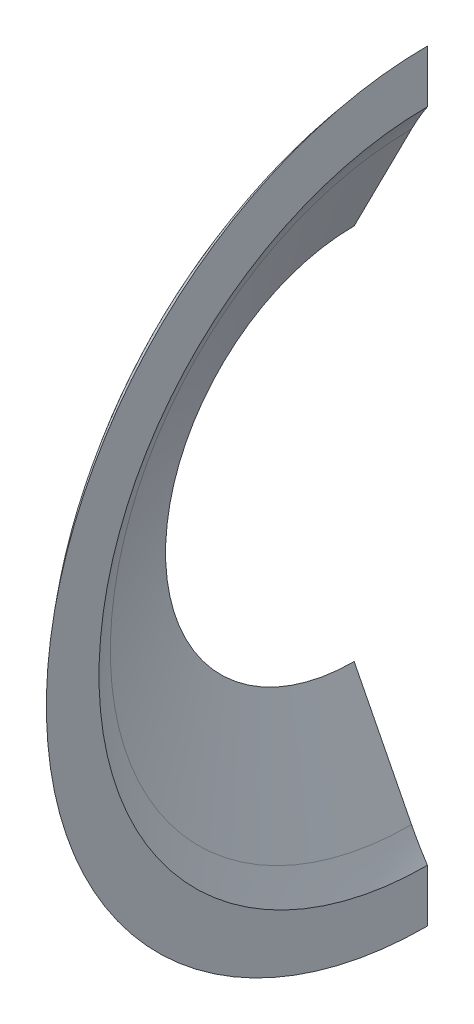
ISO-10303-21;
HEADER;
FILE_DESCRIPTION(('STEP AP214'),'2;1');
FILE_NAME('part.step','',(''),(''),'','','');
FILE_SCHEMA(('AUTOMOTIVE_DESIGN { 1 0 10303 214 1 1 1 1 }'));
ENDSEC;
DATA;
#1=APPLICATION_CONTEXT('core data for automotive mechanical design processes');
#2=APPLICATION_PROTOCOL_DEFINITION('international standard','automotive_design',2000,#1);
#3=PRODUCT_CONTEXT('',#1,'mechanical');
#4=PRODUCT('Part','Part','',(#3));
#5=PRODUCT_RELATED_PRODUCT_CATEGORY('part','',(#4));
#6=PRODUCT_DEFINITION_FORMATION('','',#4);
#7=PRODUCT_DEFINITION_CONTEXT('part definition',#1,'design');
#8=PRODUCT_DEFINITION('design','',#6,#7);
#9=PRODUCT_DEFINITION_SHAPE('','',#8);
#10=(LENGTH_UNIT() NAMED_UNIT(*) SI_UNIT(.MILLI.,.METRE.));
#11=(NAMED_UNIT(*) PLANE_ANGLE_UNIT() SI_UNIT($,.RADIAN.));
#12=(NAMED_UNIT(*) SI_UNIT($,.STERADIAN.) SOLID_ANGLE_UNIT());
#13=UNCERTAINTY_MEASURE_WITH_UNIT(LENGTH_MEASURE(1.E-05),#10,'distance_accuracy_value','');
#14=(GEOMETRIC_REPRESENTATION_CONTEXT(3) GLOBAL_UNCERTAINTY_ASSIGNED_CONTEXT((#13)) GLOBAL_UNIT_ASSIGNED_CONTEXT((#10,
#11,#12)) REPRESENTATION_CONTEXT('',''));
#15=CARTESIAN_POINT('',(0.,0.,0.));
#16=DIRECTION('',(0.,0.,1.));
#17=DIRECTION('',(1.,0.,0.));
#18=AXIS2_PLACEMENT_3D('',#15,#16,#17);
#19=CARTESIAN_POINT('',(-179.07280512789,0.,0.));
#20=DIRECTION('',(-1.,0.,0.));
#21=DIRECTION('',(0.,0.,1.));
#22=AXIS2_PLACEMENT_3D('',#19,#20,#21);
#23=DEGENERATE_TOROIDAL_SURFACE('',#22,30.53907071447,47.69293188482,.T.);
#24=CARTESIAN_POINT('',(-179.07280512789,30.53907071447,0.));
#25=DIRECTION('',(0.,0.,1.));
#26=DIRECTION('',(1.,0.,0.));
#27=AXIS2_PLACEMENT_3D('',#24,#25,#26);
#28=CIRCLE('',#27,47.69293188482);
#29=CARTESIAN_POINT('',(-218.809194131512,56.9139667469262,0.));
#30=VERTEX_POINT('',#29);
#31=CARTESIAN_POINT('',(-221.567518594936,52.1912086949035,0.));
#32=VERTEX_POINT('',#31);
#33=EDGE_CURVE('E142',#30,#32,#28,.T.);
#34=ORIENTED_EDGE('',*,*,#33,.F.);
#35=CARTESIAN_POINT('',(-218.809194131512,0.,0.));
#36=DIRECTION('',(-1.,0.,0.));
#37=DIRECTION('',(0.,0.,1.));
#38=AXIS2_PLACEMENT_3D('',#35,#36,#37);
#39=CIRCLE('',#38,56.9139667469262);
#40=CARTESIAN_POINT('',(-218.809194131512,-56.9139667469262,0.));
#41=VERTEX_POINT('',#40);
#42=EDGE_CURVE('E116',#41,#30,#39,.T.);
#43=ORIENTED_EDGE('',*,*,#42,.F.);
#44=CARTESIAN_POINT('',(-179.07280512789,-30.53907071447,0.));
#45=DIRECTION('',(0.,0.,1.));
#46=DIRECTION('',(1.,0.,0.));
#47=AXIS2_PLACEMENT_3D('',#44,#45,#46);
#48=CIRCLE('',#47,47.69293188482);
#49=CARTESIAN_POINT('',(-221.567518594936,-52.1912086949035,0.));
#50=VERTEX_POINT('',#49);
#51=EDGE_CURVE('E106',#50,#41,#48,.T.);
#52=ORIENTED_EDGE('',*,*,#51,.F.);
#53=CARTESIAN_POINT('',(-221.567518594936,0.,0.));
#54=DIRECTION('',(1.,0.,0.));
#55=DIRECTION('',(0.,0.,-1.));
#56=AXIS2_PLACEMENT_3D('',#53,#54,#55);
#57=CIRCLE('',#56,52.1912086949035);
#58=EDGE_CURVE('E104',#50,#32,#57,.F.);
#59=ORIENTED_EDGE('',*,*,#58,.T.);
#60=EDGE_LOOP('',(#34,#43,#52,#59));
#61=FACE_BOUND('',#60,.T.);
#62=ADVANCED_FACE('F38',(#61),#23,.F.);
#63=CARTESIAN_POINT('',(-237.292325302457,0.,0.));
#64=DIRECTION('',(1.,0.,0.));
#65=DIRECTION('',(0.,0.,-1.));
#66=AXIS2_PLACEMENT_3D('',#63,#64,#65);
#67=CONICAL_SURFACE('',#66,21.3295378536845,1.09955742875643);
#68=ORIENTED_EDGE('',*,*,#58,.F.);
#69=DIRECTION('',(0.453990499739544,-0.891006524188369,0.));
#70=VECTOR('',#69,1.);
#71=CARTESIAN_POINT('',(-248.160267664864,0.,0.));
#72=LINE('',#71,#70);
#73=CARTESIAN_POINT('',(-231.509194131512,-32.6795718444951,0.));
#74=VERTEX_POINT('',#73);
#75=EDGE_CURVE('E90',#50,#74,#72,.F.);
#76=ORIENTED_EDGE('',*,*,#75,.T.);
#77=CARTESIAN_POINT('',(-231.509194131512,0.,0.));
#78=DIRECTION('',(1.,0.,0.));
#79=DIRECTION('',(0.,0.,-1.));
#80=AXIS2_PLACEMENT_3D('',#77,#78,#79);
#81=CIRCLE('',#80,32.6795718444951);
#82=CARTESIAN_POINT('',(-231.509194131512,32.6795718444951,0.));
#83=VERTEX_POINT('',#82);
#84=EDGE_CURVE('E102',#74,#83,#81,.F.);
#85=ORIENTED_EDGE('',*,*,#84,.T.);
#86=DIRECTION('',(-0.453990499739544,-0.891006524188369,0.));
#87=VECTOR('',#86,1.);
#88=CARTESIAN_POINT('',(-248.160267664864,0.,0.));
#89=LINE('',#88,#87);
#90=EDGE_CURVE('E54',#83,#32,#89,.F.);
#91=ORIENTED_EDGE('',*,*,#90,.T.);
#92=EDGE_LOOP('',(#68,#76,#85,#91));
#93=FACE_BOUND('',#92,.T.);
#94=ADVANCED_FACE('F101',(#93),#67,.F.);
#95=CARTESIAN_POINT('',(-218.809194131512,0.,0.));
#96=DIRECTION('',(-1.,0.,0.));
#97=DIRECTION('',(0.,0.,1.));
#98=AXIS2_PLACEMENT_3D('',#95,#96,#97);
#99=PLANE('',#98);
#100=CARTESIAN_POINT('',(-218.809194131512,0.,0.));
#101=DIRECTION('',(-1.,0.,0.));
#102=DIRECTION('',(0.,0.,1.));
#103=AXIS2_PLACEMENT_3D('',#100,#101,#102);
#104=CIRCLE('',#103,66.0338180930276);
#105=CARTESIAN_POINT('',(-218.809194131512,-66.0338180930276,0.));
#106=VERTEX_POINT('',#105);
#107=CARTESIAN_POINT('',(-218.809194131512,66.0338180930276,0.));
#108=VERTEX_POINT('',#107);
#109=EDGE_CURVE('E110',#106,#108,#104,.T.);
#110=ORIENTED_EDGE('',*,*,#109,.F.);
#111=DIRECTION('',(0.,1.,0.));
#112=VECTOR('',#111,1.);
#113=CARTESIAN_POINT('',(-218.809194131512,0.,0.));
#114=LINE('',#113,#112);
#115=EDGE_CURVE('E146',#106,#41,#114,.T.);
#116=ORIENTED_EDGE('',*,*,#115,.T.);
#117=ORIENTED_EDGE('',*,*,#42,.T.);
#118=EDGE_CURVE('E118',#30,#108,#114,.T.);
#119=ORIENTED_EDGE('',*,*,#118,.T.);
#120=EDGE_LOOP('',(#110,#116,#117,#119));
#121=FACE_BOUND('',#120,.T.);
#122=ADVANCED_FACE('F163',(#121),#99,.F.);
#123=CARTESIAN_POINT('',(-242.271269759622,0.,0.));
#124=DIRECTION('',(1.,0.,0.));
#125=DIRECTION('',(0.,0.,-1.));
#126=AXIS2_PLACEMENT_3D('',#123,#124,#125);
#127=CONICAL_SURFACE('',#126,23.866436766229,1.09955742875643);
#128=DIRECTION('',(0.453990499739544,-0.891006524188369,0.));
#129=VECTOR('',#128,1.);
#130=CARTESIAN_POINT('',(-254.431826680765,0.,0.));
#131=LINE('',#130,#129);
#132=CARTESIAN_POINT('',(-226.546463052101,-54.7281076074481,0.));
#133=VERTEX_POINT('',#132);
#134=CARTESIAN_POINT('',(-231.509194131512,-44.9881994549977,0.));
#135=VERTEX_POINT('',#134);
#136=EDGE_CURVE('E61',#133,#135,#131,.F.);
#137=ORIENTED_EDGE('',*,*,#136,.F.);
#138=CARTESIAN_POINT('',(-226.546463052101,0.,0.));
#139=DIRECTION('',(-1.,0.,0.));
#140=DIRECTION('',(0.,0.,1.));
#141=AXIS2_PLACEMENT_3D('',#138,#139,#140);
#142=CIRCLE('',#141,54.7281076074481);
#143=CARTESIAN_POINT('',(-226.546463052101,54.7281076074481,0.));
#144=VERTEX_POINT('',#143);
#145=EDGE_CURVE('E97',#133,#144,#142,.T.);
#146=ORIENTED_EDGE('',*,*,#145,.T.);
#147=DIRECTION('',(-0.453990499739544,-0.891006524188369,0.));
#148=VECTOR('',#147,1.);
#149=CARTESIAN_POINT('',(-254.431826680765,0.,0.));
#150=LINE('',#149,#148);
#151=CARTESIAN_POINT('',(-231.509194131512,44.9881994549977,0.));
#152=VERTEX_POINT('',#151);
#153=EDGE_CURVE('E134',#152,#144,#150,.F.);
#154=ORIENTED_EDGE('',*,*,#153,.F.);
#155=CARTESIAN_POINT('',(-231.509194131512,0.,0.));
#156=DIRECTION('',(1.,0.,0.));
#157=DIRECTION('',(0.,0.,-1.));
#158=AXIS2_PLACEMENT_3D('',#155,#156,#157);
#159=CIRCLE('',#158,44.9881994549977);
#160=EDGE_CURVE('E111',#135,#152,#159,.F.);
#161=ORIENTED_EDGE('',*,*,#160,.F.);
#162=EDGE_LOOP('',(#137,#146,#154,#161));
#163=FACE_BOUND('',#162,.T.);
#164=ADVANCED_FACE('F133',(#163),#127,.T.);
#165=CARTESIAN_POINT('',(-179.07280512789,0.,0.));
#166=DIRECTION('',(-1.,0.,0.));
#167=DIRECTION('',(0.,0.,1.));
#168=AXIS2_PLACEMENT_3D('',#165,#166,#167);
#169=DEGENERATE_TOROIDAL_SURFACE('',#168,30.53907071447,53.28093188482,.T.);
#170=ORIENTED_EDGE('',*,*,#109,.T.);
#171=CARTESIAN_POINT('',(-179.07280512789,30.53907071447,0.));
#172=DIRECTION('',(0.,0.,1.));
#173=DIRECTION('',(1.,0.,0.));
#174=AXIS2_PLACEMENT_3D('',#171,#172,#173);
#175=CIRCLE('',#174,53.28093188482);
#176=EDGE_CURVE('E121',#108,#144,#175,.T.);
#177=ORIENTED_EDGE('',*,*,#176,.T.);
#178=ORIENTED_EDGE('',*,*,#145,.F.);
#179=CARTESIAN_POINT('',(-179.07280512789,-30.53907071447,0.));
#180=DIRECTION('',(0.,0.,1.));
#181=DIRECTION('',(1.,0.,0.));
#182=AXIS2_PLACEMENT_3D('',#179,#180,#181);
#183=CIRCLE('',#182,53.28093188482);
#184=EDGE_CURVE('E138',#133,#106,#183,.T.);
#185=ORIENTED_EDGE('',*,*,#184,.T.);
#186=EDGE_LOOP('',(#170,#177,#178,#185));
#187=FACE_BOUND('',#186,.T.);
#188=ADVANCED_FACE('F40',(#187),#169,.T.);
#189=CARTESIAN_POINT('',(-231.509194131512,0.,0.));
#190=DIRECTION('',(1.,0.,0.));
#191=DIRECTION('',(0.,0.,-1.));
#192=AXIS2_PLACEMENT_3D('',#189,#190,#191);
#193=PLANE('',#192);
#194=ORIENTED_EDGE('',*,*,#160,.T.);
#195=DIRECTION('',(0.,-1.,0.));
#196=VECTOR('',#195,1.);
#197=CARTESIAN_POINT('',(-231.509194131512,0.,0.));
#198=LINE('',#197,#196);
#199=EDGE_CURVE('E11',#152,#83,#198,.T.);
#200=ORIENTED_EDGE('',*,*,#199,.T.);
#201=ORIENTED_EDGE('',*,*,#84,.F.);
#202=EDGE_CURVE('E42',#74,#135,#198,.T.);
#203=ORIENTED_EDGE('',*,*,#202,.T.);
#204=EDGE_LOOP('',(#194,#200,#201,#203));
#205=FACE_BOUND('',#204,.T.);
#206=ADVANCED_FACE('F108',(#205),#193,.F.);
#207=CARTESIAN_POINT('',(0.,0.,0.));
#208=DIRECTION('',(0.,0.,1.));
#209=DIRECTION('',(1.,0.,0.));
#210=AXIS2_PLACEMENT_3D('',#207,#208,#209);
#211=PLANE('',#210);
#212=ORIENTED_EDGE('',*,*,#184,.F.);
#213=ORIENTED_EDGE('',*,*,#136,.T.);
#214=ORIENTED_EDGE('',*,*,#202,.F.);
#215=ORIENTED_EDGE('',*,*,#75,.F.);
#216=ORIENTED_EDGE('',*,*,#51,.T.);
#217=ORIENTED_EDGE('',*,*,#115,.F.);
#218=EDGE_LOOP('',(#212,#213,#214,#215,#216,#217));
#219=FACE_BOUND('',#218,.T.);
#220=ADVANCED_FACE('F89',(#219),#211,.F.);
#221=ORIENTED_EDGE('',*,*,#33,.T.);
#222=ORIENTED_EDGE('',*,*,#90,.F.);
#223=ORIENTED_EDGE('',*,*,#199,.F.);
#224=ORIENTED_EDGE('',*,*,#153,.T.);
#225=ORIENTED_EDGE('',*,*,#176,.F.);
#226=ORIENTED_EDGE('',*,*,#118,.F.);
#227=EDGE_LOOP('',(#221,#222,#223,#224,#225,#226));
#228=FACE_BOUND('',#227,.T.);
#229=ADVANCED_FACE('F214',(#228),#211,.F.);
#230=CLOSED_SHELL('',(#62,#94,#122,#164,#188,#206,#220,#229));
#231=MANIFOLD_SOLID_BREP('B2',#230);
#232=ADVANCED_BREP_SHAPE_REPRESENTATION('',(#18,#231),#14);
#233=SHAPE_DEFINITION_REPRESENTATION(#9,#232);
ENDSEC;
END-ISO-10303-21;
